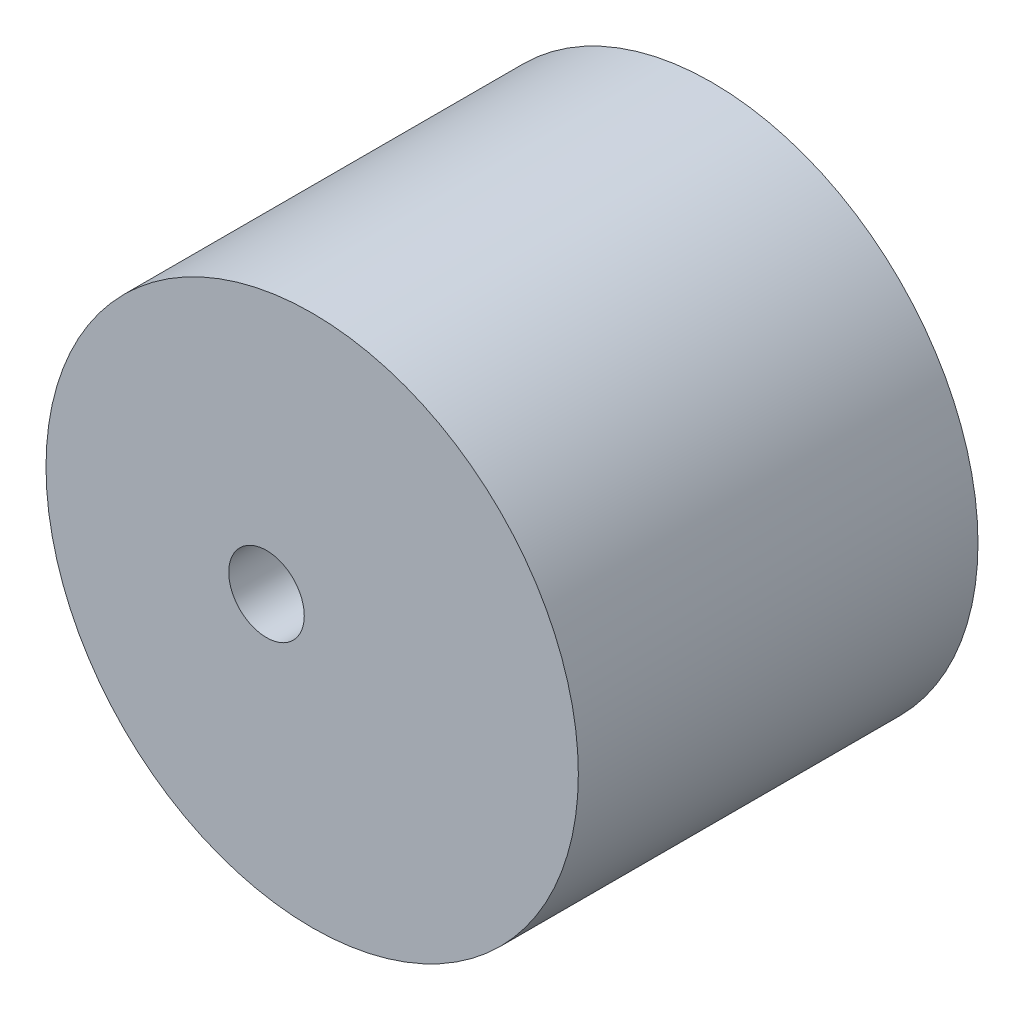
ISO-10303-21;
HEADER;
FILE_DESCRIPTION(('STEP AP214'),'2;1');
FILE_NAME('part.step','',(''),(''),'','','');
FILE_SCHEMA(('AUTOMOTIVE_DESIGN { 1 0 10303 214 1 1 1 1 }'));
ENDSEC;
DATA;
#1=APPLICATION_CONTEXT('core data for automotive mechanical design processes');
#2=APPLICATION_PROTOCOL_DEFINITION('international standard','automotive_design',2000,#1);
#3=PRODUCT_CONTEXT('',#1,'mechanical');
#4=PRODUCT('Part','Part','',(#3));
#5=PRODUCT_RELATED_PRODUCT_CATEGORY('part','',(#4));
#6=PRODUCT_DEFINITION_FORMATION('','',#4);
#7=PRODUCT_DEFINITION_CONTEXT('part definition',#1,'design');
#8=PRODUCT_DEFINITION('design','',#6,#7);
#9=PRODUCT_DEFINITION_SHAPE('','',#8);
#10=(LENGTH_UNIT() NAMED_UNIT(*) SI_UNIT(.MILLI.,.METRE.));
#11=(NAMED_UNIT(*) PLANE_ANGLE_UNIT() SI_UNIT($,.RADIAN.));
#12=(NAMED_UNIT(*) SI_UNIT($,.STERADIAN.) SOLID_ANGLE_UNIT());
#13=UNCERTAINTY_MEASURE_WITH_UNIT(LENGTH_MEASURE(1.E-05),#10,'distance_accuracy_value','');
#14=(GEOMETRIC_REPRESENTATION_CONTEXT(3) GLOBAL_UNCERTAINTY_ASSIGNED_CONTEXT((#13)) GLOBAL_UNIT_ASSIGNED_CONTEXT((#10,
#11,#12)) REPRESENTATION_CONTEXT('',''));
#15=CARTESIAN_POINT('',(0.,0.,0.));
#16=DIRECTION('',(0.,0.,1.));
#17=DIRECTION('',(1.,0.,0.));
#18=AXIS2_PLACEMENT_3D('',#15,#16,#17);
#19=CARTESIAN_POINT('',(0.,0.,35.));
#20=DIRECTION('',(0.,0.,1.));
#21=DIRECTION('',(1.,0.,0.));
#22=AXIS2_PLACEMENT_3D('',#19,#20,#21);
#23=PLANE('',#22);
#24=CARTESIAN_POINT('',(0.,0.,35.));
#25=DIRECTION('',(0.,0.,1.));
#26=DIRECTION('',(1.,0.,0.));
#27=AXIS2_PLACEMENT_3D('',#24,#25,#26);
#28=CIRCLE('',#27,23.310625);
#29=CARTESIAN_POINT('',(23.310625,0.,35.));
#30=VERTEX_POINT('',#29);
#31=EDGE_CURVE('E10',#30,#30,#28,.T.);
#32=ORIENTED_EDGE('',*,*,#31,.T.);
#33=EDGE_LOOP('',(#32));
#34=FACE_BOUND('',#33,.T.);
#35=CARTESIAN_POINT('',(-4.,0.,35.));
#36=DIRECTION('',(0.,0.,1.));
#37=DIRECTION('',(1.,0.,0.));
#38=AXIS2_PLACEMENT_3D('',#35,#36,#37);
#39=CIRCLE('',#38,3.3085);
#40=CARTESIAN_POINT('',(-0.6915,0.,35.));
#41=VERTEX_POINT('',#40);
#42=EDGE_CURVE('E50',#41,#41,#39,.T.);
#43=ORIENTED_EDGE('',*,*,#42,.F.);
#44=EDGE_LOOP('',(#43));
#45=FACE_BOUND('',#44,.T.);
#46=ADVANCED_FACE('F37',(#34,#45),#23,.T.);
#47=CARTESIAN_POINT('',(0.,0.,0.));
#48=DIRECTION('',(0.,0.,1.));
#49=DIRECTION('',(1.,0.,0.));
#50=AXIS2_PLACEMENT_3D('',#47,#48,#49);
#51=PLANE('',#50);
#52=CARTESIAN_POINT('',(0.,0.,0.));
#53=DIRECTION('',(0.,0.,1.));
#54=DIRECTION('',(1.,0.,0.));
#55=AXIS2_PLACEMENT_3D('',#52,#53,#54);
#56=CIRCLE('',#55,23.310625);
#57=CARTESIAN_POINT('',(23.310625,0.,0.));
#58=VERTEX_POINT('',#57);
#59=EDGE_CURVE('E41',#58,#58,#56,.T.);
#60=ORIENTED_EDGE('',*,*,#59,.F.);
#61=EDGE_LOOP('',(#60));
#62=FACE_BOUND('',#61,.T.);
#63=CARTESIAN_POINT('',(-4.,0.,0.));
#64=DIRECTION('',(0.,0.,1.));
#65=DIRECTION('',(1.,0.,0.));
#66=AXIS2_PLACEMENT_3D('',#63,#64,#65);
#67=CIRCLE('',#66,3.3085);
#68=CARTESIAN_POINT('',(-0.6915,0.,0.));
#69=VERTEX_POINT('',#68);
#70=EDGE_CURVE('E52',#69,#69,#67,.T.);
#71=ORIENTED_EDGE('',*,*,#70,.T.);
#72=EDGE_LOOP('',(#71));
#73=FACE_BOUND('',#72,.T.);
#74=ADVANCED_FACE('F64',(#62,#73),#51,.F.);
#75=CARTESIAN_POINT('',(0.,0.,35.));
#76=DIRECTION('',(0.,0.,-1.));
#77=DIRECTION('',(-1.,0.,0.));
#78=AXIS2_PLACEMENT_3D('',#75,#76,#77);
#79=CYLINDRICAL_SURFACE('',#78,23.310625);
#80=ORIENTED_EDGE('',*,*,#31,.F.);
#81=EDGE_LOOP('',(#80));
#82=FACE_BOUND('',#81,.T.);
#83=ORIENTED_EDGE('',*,*,#59,.T.);
#84=EDGE_LOOP('',(#83));
#85=FACE_BOUND('',#84,.T.);
#86=ADVANCED_FACE('F39',(#82,#85),#79,.T.);
#87=CARTESIAN_POINT('',(-4.,0.,35.));
#88=DIRECTION('',(0.,0.,-1.));
#89=DIRECTION('',(-1.,0.,0.));
#90=AXIS2_PLACEMENT_3D('',#87,#88,#89);
#91=CYLINDRICAL_SURFACE('',#90,3.3085);
#92=ORIENTED_EDGE('',*,*,#42,.T.);
#93=EDGE_LOOP('',(#92));
#94=FACE_BOUND('',#93,.T.);
#95=ORIENTED_EDGE('',*,*,#70,.F.);
#96=EDGE_LOOP('',(#95));
#97=FACE_BOUND('',#96,.T.);
#98=ADVANCED_FACE('F60',(#94,#97),#91,.F.);
#99=CLOSED_SHELL('',(#46,#74,#86,#98));
#100=MANIFOLD_SOLID_BREP('B2',#99);
#101=ADVANCED_BREP_SHAPE_REPRESENTATION('',(#18,#100),#14);
#102=SHAPE_DEFINITION_REPRESENTATION(#9,#101);
ENDSEC;
END-ISO-10303-21;
